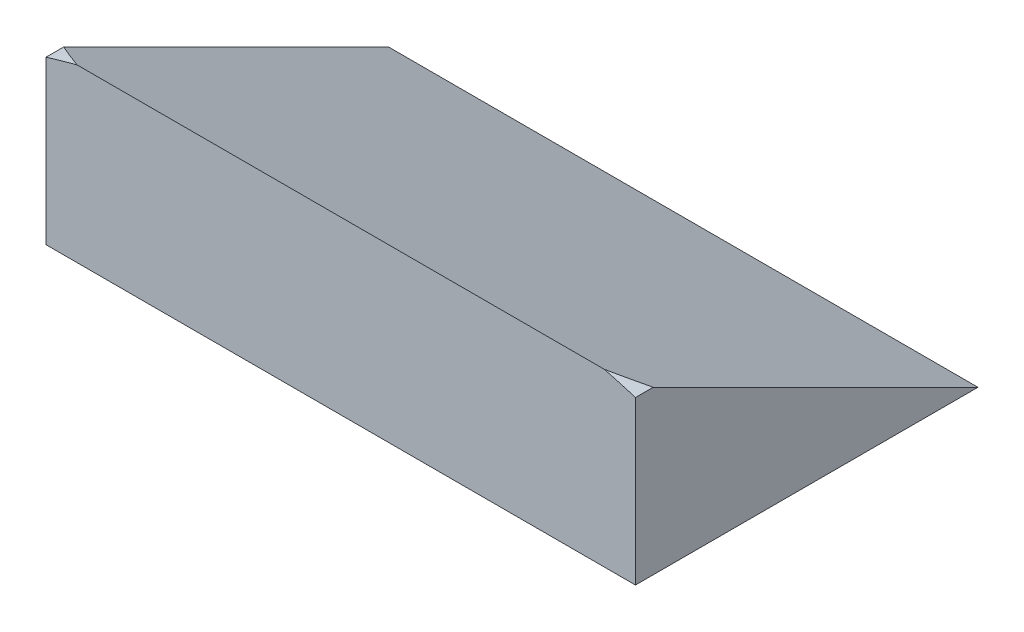
ISO-10303-21;
HEADER;
FILE_DESCRIPTION(('STEP AP214'),'2;1');
FILE_NAME('part.step','',(''),(''),'','','');
FILE_SCHEMA(('AUTOMOTIVE_DESIGN { 1 0 10303 214 1 1 1 1 }'));
ENDSEC;
DATA;
#1=APPLICATION_CONTEXT('core data for automotive mechanical design processes');
#2=APPLICATION_PROTOCOL_DEFINITION('international standard','automotive_design',2000,#1);
#3=PRODUCT_CONTEXT('',#1,'mechanical');
#4=PRODUCT('Part','Part','',(#3));
#5=PRODUCT_RELATED_PRODUCT_CATEGORY('part','',(#4));
#6=PRODUCT_DEFINITION_FORMATION('','',#4);
#7=PRODUCT_DEFINITION_CONTEXT('part definition',#1,'design');
#8=PRODUCT_DEFINITION('design','',#6,#7);
#9=PRODUCT_DEFINITION_SHAPE('','',#8);
#10=(LENGTH_UNIT() NAMED_UNIT(*) SI_UNIT(.MILLI.,.METRE.));
#11=(NAMED_UNIT(*) PLANE_ANGLE_UNIT() SI_UNIT($,.RADIAN.));
#12=(NAMED_UNIT(*) SI_UNIT($,.STERADIAN.) SOLID_ANGLE_UNIT());
#13=UNCERTAINTY_MEASURE_WITH_UNIT(LENGTH_MEASURE(1.E-05),#10,'distance_accuracy_value','');
#14=(GEOMETRIC_REPRESENTATION_CONTEXT(3) GLOBAL_UNCERTAINTY_ASSIGNED_CONTEXT((#13)) GLOBAL_UNIT_ASSIGNED_CONTEXT((#10,
#11,#12)) REPRESENTATION_CONTEXT('',''));
#15=CARTESIAN_POINT('',(0.,0.,0.));
#16=DIRECTION('',(0.,0.,1.));
#17=DIRECTION('',(1.,0.,0.));
#18=AXIS2_PLACEMENT_3D('',#15,#16,#17);
#19=CARTESIAN_POINT('',(0.,0.,-200.));
#20=DIRECTION('',(0.,0.,1.));
#21=DIRECTION('',(-1.,0.,0.));
#22=AXIS2_PLACEMENT_3D('',#19,#20,#21);
#23=ELLIPSE('',#22,244.,110.);
#24=DIRECTION('',(0.,0.,1.));
#25=VECTOR('',#24,1.);
#26=SURFACE_OF_LINEAR_EXTRUSION('',#23,#25);
#27=CARTESIAN_POINT('',(-137.5,90.8709218561961,-8.25815628760781));
#28=CARTESIAN_POINT('',(-135.13908720127,91.5969683139592,-6.80606337208149));
#29=CARTESIAN_POINT('',(-132.749829836539,92.3043260435469,-5.3913479129062));
#30=CARTESIAN_POINT('',(-129.850274701511,93.1302585201459,-3.73948295970811));
#31=CARTESIAN_POINT('',(-129.365991957645,93.2671345079125,-3.46573098417498));
#32=CARTESIAN_POINT('',(-128.395255019205,93.5393626265746,-2.9212747468509));
#33=CARTESIAN_POINT('',(-127.908800717868,93.6747146813678,-2.65057063726434));
#34=CARTESIAN_POINT('',(-126.933721001779,93.9438941531523,-2.11221169369542));
#35=CARTESIAN_POINT('',(-126.445095375918,94.0777214171761,-1.84455716564771));
#36=CARTESIAN_POINT('',(-125.465671730305,94.3438506468701,-1.31229870625987));
#37=CARTESIAN_POINT('',(-124.974873397265,94.4761523819518,-1.04769523609637));
#38=CARTESIAN_POINT('',(-123.991103095597,94.7392295968599,-0.521540806280165));
#39=CARTESIAN_POINT('',(-123.498130713766,94.8700047676542,-0.259990464691672));
#40=CARTESIAN_POINT('',(-123.004132161995,95.,0.));
#41=B_SPLINE_CURVE_WITH_KNOTS('',3,(#27,#28,#29,#30,#31,#32,#33,#34,#35,#36,#37,#38,#39,#40),
.UNSPECIFIED.,.F.,.F.,(4,2,2,2,2,2,4),(0.,8.5945981368286,10.313261381524,12.0320100755443,
13.7509297029217,15.4701058312368,17.1896241496722),.UNSPECIFIED.);
#42=CARTESIAN_POINT('',(-137.5,90.870921856196,-8.2581562876079));
#43=VERTEX_POINT('',#42);
#44=CARTESIAN_POINT('',(-123.004132161995,95.,0.));
#45=VERTEX_POINT('',#44);
#46=EDGE_CURVE('E50',#43,#45,#41,.T.);
#47=ORIENTED_EDGE('',*,*,#46,.F.);
#48=DIRECTION('',(0.,0.,1.));
#49=VECTOR('',#48,1.);
#50=CARTESIAN_POINT('',(-137.5,90.8709218561961,-200.));
#51=LINE('',#50,#49);
#52=CARTESIAN_POINT('',(-137.5,90.8709218561961,0.));
#53=VERTEX_POINT('',#52);
#54=EDGE_CURVE('E101',#43,#53,#51,.T.);
#55=ORIENTED_EDGE('',*,*,#54,.T.);
#56=CARTESIAN_POINT('',(0.,0.,0.));
#57=DIRECTION('',(0.,0.,1.));
#58=DIRECTION('',(-1.,0.,0.));
#59=AXIS2_PLACEMENT_3D('',#56,#57,#58);
#60=ELLIPSE('',#59,244.,110.);
#61=EDGE_CURVE('E110',#45,#53,#60,.T.);
#62=ORIENTED_EDGE('',*,*,#61,.F.);
#63=EDGE_LOOP('',(#47,#55,#62));
#64=FACE_BOUND('',#63,.T.);
#65=ADVANCED_FACE('F35',(#64),#26,.T.);
#66=CARTESIAN_POINT('',(137.5,15.1,-200.));
#67=DIRECTION('',(0.,-1.,0.));
#68=DIRECTION('',(0.,0.,-1.));
#69=AXIS2_PLACEMENT_3D('',#66,#67,#68);
#70=PLANE('',#69);
#71=DIRECTION('',(-1.,0.,0.));
#72=VECTOR('',#71,1.);
#73=CARTESIAN_POINT('',(137.5,15.1,-159.8));
#74=LINE('',#73,#72);
#75=CARTESIAN_POINT('',(137.5,15.1,-159.8));
#76=VERTEX_POINT('',#75);
#77=CARTESIAN_POINT('',(-137.5,15.1,-159.8));
#78=VERTEX_POINT('',#77);
#79=EDGE_CURVE('E116',#76,#78,#74,.T.);
#80=ORIENTED_EDGE('',*,*,#79,.F.);
#81=DIRECTION('',(0.,0.,1.));
#82=VECTOR('',#81,1.);
#83=CARTESIAN_POINT('',(137.5,15.1,-200.));
#84=LINE('',#83,#82);
#85=CARTESIAN_POINT('',(137.5,15.1,0.));
#86=VERTEX_POINT('',#85);
#87=EDGE_CURVE('E96',#76,#86,#84,.T.);
#88=ORIENTED_EDGE('',*,*,#87,.T.);
#89=DIRECTION('',(1.,0.,0.));
#90=VECTOR('',#89,1.);
#91=CARTESIAN_POINT('',(137.5,15.1,0.));
#92=LINE('',#91,#90);
#93=CARTESIAN_POINT('',(-137.5,15.1,0.));
#94=VERTEX_POINT('',#93);
#95=EDGE_CURVE('E113',#94,#86,#92,.T.);
#96=ORIENTED_EDGE('',*,*,#95,.F.);
#97=DIRECTION('',(0.,0.,1.));
#98=VECTOR('',#97,1.);
#99=CARTESIAN_POINT('',(-137.5,15.1,-200.));
#100=LINE('',#99,#98);
#101=EDGE_CURVE('E43',#78,#94,#100,.T.);
#102=ORIENTED_EDGE('',*,*,#101,.F.);
#103=EDGE_LOOP('',(#80,#88,#96,#102));
#104=FACE_BOUND('',#103,.T.);
#105=ADVANCED_FACE('F37',(#104),#70,.T.);
#106=CARTESIAN_POINT('',(-137.5,15.1,-200.));
#107=DIRECTION('',(-1.,0.,0.));
#108=DIRECTION('',(0.,0.,1.));
#109=AXIS2_PLACEMENT_3D('',#106,#107,#108);
#110=PLANE('',#109);
#111=DIRECTION('',(0.,-0.447213595499958,-0.894427190999916));
#112=VECTOR('',#111,1.);
#113=CARTESIAN_POINT('',(-137.5,95.,0.));
#114=LINE('',#113,#112);
#115=EDGE_CURVE('E89',#43,#78,#114,.T.);
#116=ORIENTED_EDGE('',*,*,#115,.T.);
#117=ORIENTED_EDGE('',*,*,#101,.T.);
#118=DIRECTION('',(0.,-1.,0.));
#119=VECTOR('',#118,1.);
#120=CARTESIAN_POINT('',(-137.5,15.1,0.));
#121=LINE('',#120,#119);
#122=EDGE_CURVE('E104',#53,#94,#121,.T.);
#123=ORIENTED_EDGE('',*,*,#122,.F.);
#124=ORIENTED_EDGE('',*,*,#54,.F.);
#125=EDGE_LOOP('',(#116,#117,#123,#124));
#126=FACE_BOUND('',#125,.T.);
#127=ADVANCED_FACE('F124',(#126),#110,.T.);
#128=CARTESIAN_POINT('',(123.004132161995,95.,0.));
#129=CARTESIAN_POINT('',(123.498130713766,94.8700047676542,-0.259990464691675));
#130=CARTESIAN_POINT('',(123.991103095597,94.7392295968599,-0.521540806280195));
#131=CARTESIAN_POINT('',(124.974873397265,94.4761523819518,-1.04769523609644));
#132=CARTESIAN_POINT('',(125.465671730305,94.34385064687,-1.31229870625995));
#133=CARTESIAN_POINT('',(126.445095375918,94.0777214171761,-1.84455716564777));
#134=CARTESIAN_POINT('',(126.933721001779,93.9438941531523,-2.11221169369544));
#135=CARTESIAN_POINT('',(127.908800717868,93.6747146813678,-2.65057063726435));
#136=CARTESIAN_POINT('',(128.395255019205,93.5393626265745,-2.92127474685093));
#137=CARTESIAN_POINT('',(129.365991957645,93.2671345079125,-3.46573098417504));
#138=CARTESIAN_POINT('',(129.850274701511,93.1302585201459,-3.73948295970818));
#139=CARTESIAN_POINT('',(132.749829836539,92.3043260435469,-5.39134791290626));
#140=CARTESIAN_POINT('',(135.13908720127,91.5969683139593,-6.80606337208138));
#141=CARTESIAN_POINT('',(137.5,90.8709218561961,-8.25815628760787));
#142=B_SPLINE_CURVE_WITH_KNOTS('',3,(#128,#129,#130,#131,#132,#133,#134,#135,#136,#137,#138,
#139,#140,#141),.UNSPECIFIED.,.F.,.F.,(4,2,2,2,2,2,4),(0.,1.71951831843541,3.43869444675051,
5.15761407412798,6.87636276814827,8.59502601284365,17.1896241496723),.UNSPECIFIED.);
#143=CARTESIAN_POINT('',(123.004132161995,95.,0.));
#144=VERTEX_POINT('',#143);
#145=CARTESIAN_POINT('',(137.5,90.8709218561961,-8.25815628760787));
#146=VERTEX_POINT('',#145);
#147=EDGE_CURVE('E80',#144,#146,#142,.T.);
#148=ORIENTED_EDGE('',*,*,#147,.F.);
#149=CARTESIAN_POINT('',(137.5,90.8709218561961,0.));
#150=VERTEX_POINT('',#149);
#151=EDGE_CURVE('E99',#150,#144,#60,.T.);
#152=ORIENTED_EDGE('',*,*,#151,.F.);
#153=DIRECTION('',(0.,0.,1.));
#154=VECTOR('',#153,1.);
#155=CARTESIAN_POINT('',(137.5,90.8709218561961,-200.));
#156=LINE('',#155,#154);
#157=EDGE_CURVE('E95',#146,#150,#156,.T.);
#158=ORIENTED_EDGE('',*,*,#157,.F.);
#159=EDGE_LOOP('',(#148,#152,#158));
#160=FACE_BOUND('',#159,.T.);
#161=ADVANCED_FACE('F98',(#160),#26,.T.);
#162=CARTESIAN_POINT('',(137.5,90.8709218561961,-200.));
#163=DIRECTION('',(1.,0.,0.));
#164=DIRECTION('',(0.,0.,-1.));
#165=AXIS2_PLACEMENT_3D('',#162,#163,#164);
#166=PLANE('',#165);
#167=DIRECTION('',(0.,-0.447213595499958,-0.894427190999916));
#168=VECTOR('',#167,1.);
#169=CARTESIAN_POINT('',(137.5,95.,0.));
#170=LINE('',#169,#168);
#171=EDGE_CURVE('E83',#146,#76,#170,.T.);
#172=ORIENTED_EDGE('',*,*,#171,.F.);
#173=ORIENTED_EDGE('',*,*,#157,.T.);
#174=DIRECTION('',(0.,1.,0.));
#175=VECTOR('',#174,1.);
#176=CARTESIAN_POINT('',(137.5,90.8709218561961,0.));
#177=LINE('',#176,#175);
#178=EDGE_CURVE('E111',#86,#150,#177,.T.);
#179=ORIENTED_EDGE('',*,*,#178,.F.);
#180=ORIENTED_EDGE('',*,*,#87,.F.);
#181=EDGE_LOOP('',(#172,#173,#179,#180));
#182=FACE_BOUND('',#181,.T.);
#183=ADVANCED_FACE('F93',(#182),#166,.T.);
#184=CARTESIAN_POINT('',(0.,0.,0.));
#185=DIRECTION('',(0.,0.,-1.));
#186=DIRECTION('',(-1.,0.,0.));
#187=AXIS2_PLACEMENT_3D('',#184,#185,#186);
#188=PLANE('',#187);
#189=ORIENTED_EDGE('',*,*,#151,.T.);
#190=DIRECTION('',(-1.,0.,0.));
#191=VECTOR('',#190,1.);
#192=CARTESIAN_POINT('',(0.,95.,0.));
#193=LINE('',#192,#191);
#194=EDGE_CURVE('E11',#144,#45,#193,.T.);
#195=ORIENTED_EDGE('',*,*,#194,.T.);
#196=ORIENTED_EDGE('',*,*,#61,.T.);
#197=ORIENTED_EDGE('',*,*,#122,.T.);
#198=ORIENTED_EDGE('',*,*,#95,.T.);
#199=ORIENTED_EDGE('',*,*,#178,.T.);
#200=EDGE_LOOP('',(#189,#195,#196,#197,#198,#199));
#201=FACE_BOUND('',#200,.T.);
#202=ADVANCED_FACE('F137',(#201),#188,.F.);
#203=CARTESIAN_POINT('',(-137.5,95.,0.));
#204=DIRECTION('',(0.,-0.894427190999916,0.447213595499958));
#205=DIRECTION('',(0.,-0.447213595499958,-0.894427190999916));
#206=AXIS2_PLACEMENT_3D('',#203,#204,#205);
#207=PLANE('',#206);
#208=ORIENTED_EDGE('',*,*,#79,.T.);
#209=ORIENTED_EDGE('',*,*,#115,.F.);
#210=ORIENTED_EDGE('',*,*,#46,.T.);
#211=ORIENTED_EDGE('',*,*,#194,.F.);
#212=ORIENTED_EDGE('',*,*,#147,.T.);
#213=ORIENTED_EDGE('',*,*,#171,.T.);
#214=EDGE_LOOP('',(#208,#209,#210,#211,#212,#213));
#215=FACE_BOUND('',#214,.T.);
#216=ADVANCED_FACE('F82',(#215),#207,.F.);
#217=CLOSED_SHELL('',(#65,#105,#127,#161,#183,#202,#216));
#218=MANIFOLD_SOLID_BREP('B2',#217);
#219=ADVANCED_BREP_SHAPE_REPRESENTATION('',(#18,#218),#14);
#220=SHAPE_DEFINITION_REPRESENTATION(#9,#219);
ENDSEC;
END-ISO-10303-21;
